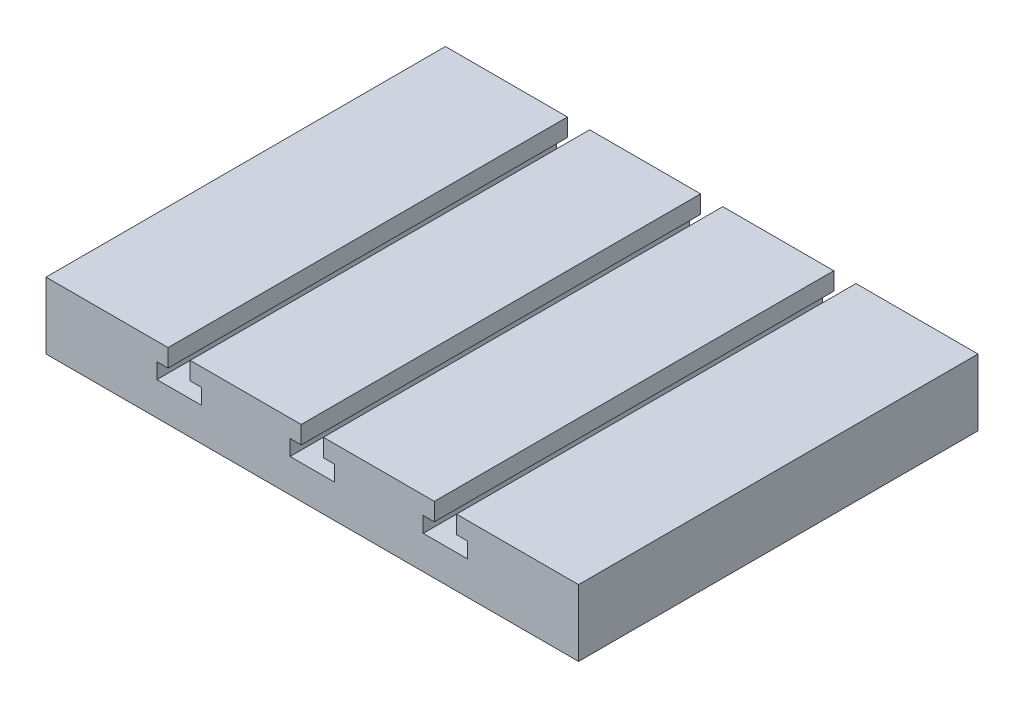
ISO-10303-21;
HEADER;
FILE_DESCRIPTION(('STEP AP214'),'2;1');
FILE_NAME('part.step','',(''),(''),'','','');
FILE_SCHEMA(('AUTOMOTIVE_DESIGN { 1 0 10303 214 1 1 1 1 }'));
ENDSEC;
DATA;
#1=APPLICATION_CONTEXT('core data for automotive mechanical design processes');
#2=APPLICATION_PROTOCOL_DEFINITION('international standard','automotive_design',2000,#1);
#3=PRODUCT_CONTEXT('',#1,'mechanical');
#4=PRODUCT('Part','Part','',(#3));
#5=PRODUCT_RELATED_PRODUCT_CATEGORY('part','',(#4));
#6=PRODUCT_DEFINITION_FORMATION('','',#4);
#7=PRODUCT_DEFINITION_CONTEXT('part definition',#1,'design');
#8=PRODUCT_DEFINITION('design','',#6,#7);
#9=PRODUCT_DEFINITION_SHAPE('','',#8);
#10=(LENGTH_UNIT() NAMED_UNIT(*) SI_UNIT(.MILLI.,.METRE.));
#11=(NAMED_UNIT(*) PLANE_ANGLE_UNIT() SI_UNIT($,.RADIAN.));
#12=(NAMED_UNIT(*) SI_UNIT($,.STERADIAN.) SOLID_ANGLE_UNIT());
#13=UNCERTAINTY_MEASURE_WITH_UNIT(LENGTH_MEASURE(1.E-05),#10,'distance_accuracy_value','');
#14=(GEOMETRIC_REPRESENTATION_CONTEXT(3) GLOBAL_UNCERTAINTY_ASSIGNED_CONTEXT((#13)) GLOBAL_UNIT_ASSIGNED_CONTEXT((#10,
#11,#12)) REPRESENTATION_CONTEXT('',''));
#15=CARTESIAN_POINT('',(0.,0.,0.));
#16=DIRECTION('',(0.,0.,1.));
#17=DIRECTION('',(1.,0.,0.));
#18=AXIS2_PLACEMENT_3D('',#15,#16,#17);
#19=CARTESIAN_POINT('',(60.,7.50000000000001,90.));
#20=DIRECTION('',(0.,-1.,0.));
#21=DIRECTION('',(1.,0.,0.));
#22=AXIS2_PLACEMENT_3D('',#19,#20,#21);
#23=PLANE('',#22);
#24=DIRECTION('',(-1.,0.,0.));
#25=VECTOR('',#24,1.);
#26=CARTESIAN_POINT('',(60.,7.50000000000001,90.));
#27=LINE('',#26,#25);
#28=CARTESIAN_POINT('',(-2.5,7.5,90.));
#29=VERTEX_POINT('',#28);
#30=CARTESIAN_POINT('',(-27.5,7.5,90.));
#31=VERTEX_POINT('',#30);
#32=EDGE_CURVE('E413',#29,#31,#27,.T.);
#33=ORIENTED_EDGE('',*,*,#32,.F.);
#34=DIRECTION('',(0.,0.,1.));
#35=VECTOR('',#34,1.);
#36=CARTESIAN_POINT('',(-2.5,7.5,0.));
#37=LINE('',#36,#35);
#38=CARTESIAN_POINT('',(-2.5,7.5,0.));
#39=VERTEX_POINT('',#38);
#40=EDGE_CURVE('E281',#39,#29,#37,.T.);
#41=ORIENTED_EDGE('',*,*,#40,.F.);
#42=DIRECTION('',(-1.,0.,0.));
#43=VECTOR('',#42,1.);
#44=CARTESIAN_POINT('',(60.,7.50000000000001,0.));
#45=LINE('',#44,#43);
#46=CARTESIAN_POINT('',(-27.5,7.5,0.));
#47=VERTEX_POINT('',#46);
#48=EDGE_CURVE('E424',#39,#47,#45,.T.);
#49=ORIENTED_EDGE('',*,*,#48,.T.);
#50=DIRECTION('',(0.,0.,1.));
#51=VECTOR('',#50,1.);
#52=CARTESIAN_POINT('',(-27.5,7.5,0.));
#53=LINE('',#52,#51);
#54=EDGE_CURVE('E304',#47,#31,#53,.T.);
#55=ORIENTED_EDGE('',*,*,#54,.T.);
#56=EDGE_LOOP('',(#33,#41,#49,#55));
#57=FACE_BOUND('',#56,.T.);
#58=ADVANCED_FACE('F33',(#57),#23,.F.);
#59=CARTESIAN_POINT('',(27.5,7.5,0.));
#60=VERTEX_POINT('',#59);
#61=CARTESIAN_POINT('',(2.5,7.5,0.));
#62=VERTEX_POINT('',#61);
#63=EDGE_CURVE('E423',#60,#62,#45,.T.);
#64=ORIENTED_EDGE('',*,*,#63,.T.);
#65=DIRECTION('',(0.,0.,1.));
#66=VECTOR('',#65,1.);
#67=CARTESIAN_POINT('',(2.5,7.5,0.));
#68=LINE('',#67,#66);
#69=CARTESIAN_POINT('',(2.5,7.5,90.));
#70=VERTEX_POINT('',#69);
#71=EDGE_CURVE('E48',#62,#70,#68,.T.);
#72=ORIENTED_EDGE('',*,*,#71,.T.);
#73=CARTESIAN_POINT('',(27.5,7.5,90.));
#74=VERTEX_POINT('',#73);
#75=EDGE_CURVE('E412',#74,#70,#27,.T.);
#76=ORIENTED_EDGE('',*,*,#75,.F.);
#77=DIRECTION('',(0.,0.,1.));
#78=VECTOR('',#77,1.);
#79=CARTESIAN_POINT('',(27.5,7.5,0.));
#80=LINE('',#79,#78);
#81=EDGE_CURVE('E395',#60,#74,#80,.T.);
#82=ORIENTED_EDGE('',*,*,#81,.F.);
#83=EDGE_LOOP('',(#64,#72,#76,#82));
#84=FACE_BOUND('',#83,.T.);
#85=ADVANCED_FACE('F458',(#84),#23,.F.);
#86=CARTESIAN_POINT('',(60.,7.50000000000001,0.));
#87=VERTEX_POINT('',#86);
#88=CARTESIAN_POINT('',(32.5,7.5,0.));
#89=VERTEX_POINT('',#88);
#90=EDGE_CURVE('E403',#87,#89,#45,.T.);
#91=ORIENTED_EDGE('',*,*,#90,.T.);
#92=DIRECTION('',(0.,0.,1.));
#93=VECTOR('',#92,1.);
#94=CARTESIAN_POINT('',(32.5,7.5,0.));
#95=LINE('',#94,#93);
#96=CARTESIAN_POINT('',(32.5,7.5,90.));
#97=VERTEX_POINT('',#96);
#98=EDGE_CURVE('E363',#89,#97,#95,.T.);
#99=ORIENTED_EDGE('',*,*,#98,.T.);
#100=CARTESIAN_POINT('',(60.,7.50000000000001,90.));
#101=VERTEX_POINT('',#100);
#102=EDGE_CURVE('E408',#101,#97,#27,.T.);
#103=ORIENTED_EDGE('',*,*,#102,.F.);
#104=DIRECTION('',(0.,0.,-1.));
#105=VECTOR('',#104,1.);
#106=CARTESIAN_POINT('',(60.,7.50000000000001,90.));
#107=LINE('',#106,#105);
#108=EDGE_CURVE('E427',#101,#87,#107,.T.);
#109=ORIENTED_EDGE('',*,*,#108,.T.);
#110=EDGE_LOOP('',(#91,#99,#103,#109));
#111=FACE_BOUND('',#110,.T.);
#112=ADVANCED_FACE('F441',(#111),#23,.F.);
#113=CARTESIAN_POINT('',(-60.,7.49999999999999,90.));
#114=DIRECTION('',(1.,0.,0.));
#115=DIRECTION('',(0.,0.,-1.));
#116=AXIS2_PLACEMENT_3D('',#113,#114,#115);
#117=PLANE('',#116);
#118=DIRECTION('',(0.,-1.,0.));
#119=VECTOR('',#118,1.);
#120=CARTESIAN_POINT('',(-60.,7.49999999999999,0.));
#121=LINE('',#120,#119);
#122=CARTESIAN_POINT('',(-60.,7.49999999999999,0.));
#123=VERTEX_POINT('',#122);
#124=CARTESIAN_POINT('',(-60.,-7.50000000000001,0.));
#125=VERTEX_POINT('',#124);
#126=EDGE_CURVE('E384',#123,#125,#121,.T.);
#127=ORIENTED_EDGE('',*,*,#126,.T.);
#128=DIRECTION('',(0.,0.,-1.));
#129=VECTOR('',#128,1.);
#130=CARTESIAN_POINT('',(-60.,-7.50000000000001,90.));
#131=LINE('',#130,#129);
#132=CARTESIAN_POINT('',(-60.,-7.50000000000001,90.));
#133=VERTEX_POINT('',#132);
#134=EDGE_CURVE('E11',#133,#125,#131,.T.);
#135=ORIENTED_EDGE('',*,*,#134,.F.);
#136=DIRECTION('',(0.,-1.,0.));
#137=VECTOR('',#136,1.);
#138=CARTESIAN_POINT('',(-60.,7.49999999999999,90.));
#139=LINE('',#138,#137);
#140=CARTESIAN_POINT('',(-60.,7.49999999999999,90.));
#141=VERTEX_POINT('',#140);
#142=EDGE_CURVE('E399',#141,#133,#139,.T.);
#143=ORIENTED_EDGE('',*,*,#142,.F.);
#144=DIRECTION('',(0.,0.,-1.));
#145=VECTOR('',#144,1.);
#146=CARTESIAN_POINT('',(-60.,7.49999999999999,90.));
#147=LINE('',#146,#145);
#148=EDGE_CURVE('E411',#141,#123,#147,.T.);
#149=ORIENTED_EDGE('',*,*,#148,.T.);
#150=EDGE_LOOP('',(#127,#135,#143,#149));
#151=FACE_BOUND('',#150,.T.);
#152=ADVANCED_FACE('F35',(#151),#117,.F.);
#153=CARTESIAN_POINT('',(60.,-7.49999999999999,90.));
#154=DIRECTION('',(0.,1.,0.));
#155=DIRECTION('',(-1.,0.,0.));
#156=AXIS2_PLACEMENT_3D('',#153,#154,#155);
#157=PLANE('',#156);
#158=DIRECTION('',(1.,0.,0.));
#159=VECTOR('',#158,1.);
#160=CARTESIAN_POINT('',(60.,-7.49999999999999,0.));
#161=LINE('',#160,#159);
#162=CARTESIAN_POINT('',(60.,-7.49999999999999,0.));
#163=VERTEX_POINT('',#162);
#164=EDGE_CURVE('E416',#125,#163,#161,.T.);
#165=ORIENTED_EDGE('',*,*,#164,.T.);
#166=DIRECTION('',(0.,0.,-1.));
#167=VECTOR('',#166,1.);
#168=CARTESIAN_POINT('',(60.,-7.49999999999999,90.));
#169=LINE('',#168,#167);
#170=CARTESIAN_POINT('',(60.,-7.49999999999999,90.));
#171=VERTEX_POINT('',#170);
#172=EDGE_CURVE('E41',#171,#163,#169,.T.);
#173=ORIENTED_EDGE('',*,*,#172,.F.);
#174=DIRECTION('',(1.,0.,0.));
#175=VECTOR('',#174,1.);
#176=CARTESIAN_POINT('',(60.,-7.49999999999999,90.));
#177=LINE('',#176,#175);
#178=EDGE_CURVE('E402',#133,#171,#177,.T.);
#179=ORIENTED_EDGE('',*,*,#178,.F.);
#180=ORIENTED_EDGE('',*,*,#134,.T.);
#181=EDGE_LOOP('',(#165,#173,#179,#180));
#182=FACE_BOUND('',#181,.T.);
#183=ADVANCED_FACE('F450',(#182),#157,.F.);
#184=CARTESIAN_POINT('',(60.,7.50000000000001,90.));
#185=DIRECTION('',(-1.,0.,0.));
#186=DIRECTION('',(0.,0.,1.));
#187=AXIS2_PLACEMENT_3D('',#184,#185,#186);
#188=PLANE('',#187);
#189=DIRECTION('',(0.,1.,0.));
#190=VECTOR('',#189,1.);
#191=CARTESIAN_POINT('',(60.,7.50000000000001,0.));
#192=LINE('',#191,#190);
#193=EDGE_CURVE('E418',#163,#87,#192,.T.);
#194=ORIENTED_EDGE('',*,*,#193,.T.);
#195=ORIENTED_EDGE('',*,*,#108,.F.);
#196=DIRECTION('',(0.,1.,0.));
#197=VECTOR('',#196,1.);
#198=CARTESIAN_POINT('',(60.,7.50000000000001,90.));
#199=LINE('',#198,#197);
#200=EDGE_CURVE('E405',#171,#101,#199,.T.);
#201=ORIENTED_EDGE('',*,*,#200,.F.);
#202=ORIENTED_EDGE('',*,*,#172,.T.);
#203=EDGE_LOOP('',(#194,#195,#201,#202));
#204=FACE_BOUND('',#203,.T.);
#205=ADVANCED_FACE('F434',(#204),#188,.F.);
#206=CARTESIAN_POINT('',(-32.5,7.5,90.));
#207=VERTEX_POINT('',#206);
#208=EDGE_CURVE('E407',#207,#141,#27,.T.);
#209=ORIENTED_EDGE('',*,*,#208,.F.);
#210=DIRECTION('',(0.,0.,1.));
#211=VECTOR('',#210,1.);
#212=CARTESIAN_POINT('',(-32.5,7.5,0.));
#213=LINE('',#212,#211);
#214=CARTESIAN_POINT('',(-32.5,7.5,0.));
#215=VERTEX_POINT('',#214);
#216=EDGE_CURVE('E337',#215,#207,#213,.T.);
#217=ORIENTED_EDGE('',*,*,#216,.F.);
#218=EDGE_CURVE('E420',#215,#123,#45,.T.);
#219=ORIENTED_EDGE('',*,*,#218,.T.);
#220=ORIENTED_EDGE('',*,*,#148,.F.);
#221=EDGE_LOOP('',(#209,#217,#219,#220));
#222=FACE_BOUND('',#221,.T.);
#223=ADVANCED_FACE('F499',(#222),#23,.F.);
#224=CARTESIAN_POINT('',(0.,0.,90.));
#225=DIRECTION('',(0.,0.,-1.));
#226=DIRECTION('',(-1.,0.,0.));
#227=AXIS2_PLACEMENT_3D('',#224,#225,#226);
#228=PLANE('',#227);
#229=DIRECTION('',(-1.,0.,0.));
#230=VECTOR('',#229,1.);
#231=CARTESIAN_POINT('',(-5.,3.49999999999999,90.));
#232=LINE('',#231,#230);
#233=CARTESIAN_POINT('',(-2.5,3.49999999999999,90.));
#234=VERTEX_POINT('',#233);
#235=CARTESIAN_POINT('',(-5.,3.49999999999999,90.));
#236=VERTEX_POINT('',#235);
#237=EDGE_CURVE('E262',#234,#236,#232,.T.);
#238=ORIENTED_EDGE('',*,*,#237,.F.);
#239=DIRECTION('',(0.,-1.,0.));
#240=VECTOR('',#239,1.);
#241=CARTESIAN_POINT('',(-2.5,7.5,90.));
#242=LINE('',#241,#240);
#243=EDGE_CURVE('E259',#29,#234,#242,.T.);
#244=ORIENTED_EDGE('',*,*,#243,.F.);
#245=ORIENTED_EDGE('',*,*,#32,.T.);
#246=DIRECTION('',(0.,1.,0.));
#247=VECTOR('',#246,1.);
#248=CARTESIAN_POINT('',(-27.5,7.5,90.));
#249=LINE('',#248,#247);
#250=CARTESIAN_POINT('',(-27.5,3.49999999999999,90.));
#251=VERTEX_POINT('',#250);
#252=EDGE_CURVE('E272',#251,#31,#249,.T.);
#253=ORIENTED_EDGE('',*,*,#252,.F.);
#254=DIRECTION('',(-1.,0.,0.));
#255=VECTOR('',#254,1.);
#256=CARTESIAN_POINT('',(-27.5,3.49999999999999,90.));
#257=LINE('',#256,#255);
#258=CARTESIAN_POINT('',(-25.,3.49999999999999,90.));
#259=VERTEX_POINT('',#258);
#260=EDGE_CURVE('E288',#259,#251,#257,.T.);
#261=ORIENTED_EDGE('',*,*,#260,.F.);
#262=DIRECTION('',(0.,1.,0.));
#263=VECTOR('',#262,1.);
#264=CARTESIAN_POINT('',(-25.,3.49999999999999,90.));
#265=LINE('',#264,#263);
#266=CARTESIAN_POINT('',(-25.,0.,90.));
#267=VERTEX_POINT('',#266);
#268=EDGE_CURVE('E319',#267,#259,#265,.T.);
#269=ORIENTED_EDGE('',*,*,#268,.F.);
#270=DIRECTION('',(1.,0.,0.));
#271=VECTOR('',#270,1.);
#272=CARTESIAN_POINT('',(-35.,0.,90.));
#273=LINE('',#272,#271);
#274=CARTESIAN_POINT('',(-35.,0.,90.));
#275=VERTEX_POINT('',#274);
#276=EDGE_CURVE('E316',#275,#267,#273,.T.);
#277=ORIENTED_EDGE('',*,*,#276,.F.);
#278=DIRECTION('',(0.,-1.,0.));
#279=VECTOR('',#278,1.);
#280=CARTESIAN_POINT('',(-35.,3.49999999999999,90.));
#281=LINE('',#280,#279);
#282=CARTESIAN_POINT('',(-35.,3.49999999999999,90.));
#283=VERTEX_POINT('',#282);
#284=EDGE_CURVE('E313',#283,#275,#281,.T.);
#285=ORIENTED_EDGE('',*,*,#284,.F.);
#286=DIRECTION('',(-1.,0.,0.));
#287=VECTOR('',#286,1.);
#288=CARTESIAN_POINT('',(-35.,3.49999999999999,90.));
#289=LINE('',#288,#287);
#290=CARTESIAN_POINT('',(-32.5,3.49999999999999,90.));
#291=VERTEX_POINT('',#290);
#292=EDGE_CURVE('E310',#291,#283,#289,.T.);
#293=ORIENTED_EDGE('',*,*,#292,.F.);
#294=DIRECTION('',(0.,-1.,0.));
#295=VECTOR('',#294,1.);
#296=CARTESIAN_POINT('',(-32.5,7.5,90.));
#297=LINE('',#296,#295);
#298=EDGE_CURVE('E307',#207,#291,#297,.T.);
#299=ORIENTED_EDGE('',*,*,#298,.F.);
#300=ORIENTED_EDGE('',*,*,#208,.T.);
#301=ORIENTED_EDGE('',*,*,#142,.T.);
#302=ORIENTED_EDGE('',*,*,#178,.T.);
#303=ORIENTED_EDGE('',*,*,#200,.T.);
#304=ORIENTED_EDGE('',*,*,#102,.T.);
#305=DIRECTION('',(0.,1.,0.));
#306=VECTOR('',#305,1.);
#307=CARTESIAN_POINT('',(32.5,7.5,90.));
#308=LINE('',#307,#306);
#309=CARTESIAN_POINT('',(32.5,3.49999999999999,90.));
#310=VERTEX_POINT('',#309);
#311=EDGE_CURVE('E326',#310,#97,#308,.T.);
#312=ORIENTED_EDGE('',*,*,#311,.F.);
#313=DIRECTION('',(-1.,0.,0.));
#314=VECTOR('',#313,1.);
#315=CARTESIAN_POINT('',(32.5,3.49999999999999,90.));
#316=LINE('',#315,#314);
#317=CARTESIAN_POINT('',(35.,3.49999999999999,90.));
#318=VERTEX_POINT('',#317);
#319=EDGE_CURVE('E345',#318,#310,#316,.T.);
#320=ORIENTED_EDGE('',*,*,#319,.F.);
#321=DIRECTION('',(0.,1.,0.));
#322=VECTOR('',#321,1.);
#323=CARTESIAN_POINT('',(35.,3.49999999999999,90.));
#324=LINE('',#323,#322);
#325=CARTESIAN_POINT('',(35.,0.,90.));
#326=VERTEX_POINT('',#325);
#327=EDGE_CURVE('E377',#326,#318,#324,.T.);
#328=ORIENTED_EDGE('',*,*,#327,.F.);
#329=DIRECTION('',(1.,0.,0.));
#330=VECTOR('',#329,1.);
#331=CARTESIAN_POINT('',(25.,0.,90.));
#332=LINE('',#331,#330);
#333=CARTESIAN_POINT('',(25.,0.,90.));
#334=VERTEX_POINT('',#333);
#335=EDGE_CURVE('E374',#334,#326,#332,.T.);
#336=ORIENTED_EDGE('',*,*,#335,.F.);
#337=DIRECTION('',(0.,-1.,0.));
#338=VECTOR('',#337,1.);
#339=CARTESIAN_POINT('',(25.,3.49999999999999,90.));
#340=LINE('',#339,#338);
#341=CARTESIAN_POINT('',(25.,3.49999999999999,90.));
#342=VERTEX_POINT('',#341);
#343=EDGE_CURVE('E371',#342,#334,#340,.T.);
#344=ORIENTED_EDGE('',*,*,#343,.F.);
#345=DIRECTION('',(-1.,0.,0.));
#346=VECTOR('',#345,1.);
#347=CARTESIAN_POINT('',(25.,3.49999999999999,90.));
#348=LINE('',#347,#346);
#349=CARTESIAN_POINT('',(27.5,3.49999999999999,90.));
#350=VERTEX_POINT('',#349);
#351=EDGE_CURVE('E368',#350,#342,#348,.T.);
#352=ORIENTED_EDGE('',*,*,#351,.F.);
#353=DIRECTION('',(0.,-1.,0.));
#354=VECTOR('',#353,1.);
#355=CARTESIAN_POINT('',(27.5,7.5,90.));
#356=LINE('',#355,#354);
#357=EDGE_CURVE('E365',#74,#350,#356,.T.);
#358=ORIENTED_EDGE('',*,*,#357,.F.);
#359=ORIENTED_EDGE('',*,*,#75,.T.);
#360=DIRECTION('',(0.,1.,0.));
#361=VECTOR('',#360,1.);
#362=CARTESIAN_POINT('',(2.5,7.5,90.));
#363=LINE('',#362,#361);
#364=CARTESIAN_POINT('',(2.5,3.49999999999999,90.));
#365=VERTEX_POINT('',#364);
#366=EDGE_CURVE('E257',#365,#70,#363,.T.);
#367=ORIENTED_EDGE('',*,*,#366,.F.);
#368=DIRECTION('',(-1.,0.,0.));
#369=VECTOR('',#368,1.);
#370=CARTESIAN_POINT('',(2.5,3.49999999999999,90.));
#371=LINE('',#370,#369);
#372=CARTESIAN_POINT('',(4.99999999999999,3.49999999999999,90.));
#373=VERTEX_POINT('',#372);
#374=EDGE_CURVE('E225',#373,#365,#371,.T.);
#375=ORIENTED_EDGE('',*,*,#374,.F.);
#376=DIRECTION('',(0.,1.,0.));
#377=VECTOR('',#376,1.);
#378=CARTESIAN_POINT('',(4.99999999999999,3.49999999999999,90.));
#379=LINE('',#378,#377);
#380=CARTESIAN_POINT('',(4.99999999999999,0.,90.));
#381=VERTEX_POINT('',#380);
#382=EDGE_CURVE('E240',#381,#373,#379,.T.);
#383=ORIENTED_EDGE('',*,*,#382,.F.);
#384=DIRECTION('',(1.,0.,0.));
#385=VECTOR('',#384,1.);
#386=CARTESIAN_POINT('',(-5.,0.,90.));
#387=LINE('',#386,#385);
#388=CARTESIAN_POINT('',(-5.,0.,90.));
#389=VERTEX_POINT('',#388);
#390=EDGE_CURVE('E243',#389,#381,#387,.T.);
#391=ORIENTED_EDGE('',*,*,#390,.F.);
#392=DIRECTION('',(0.,-1.,0.));
#393=VECTOR('',#392,1.);
#394=CARTESIAN_POINT('',(-5.,3.49999999999999,90.));
#395=LINE('',#394,#393);
#396=EDGE_CURVE('E265',#236,#389,#395,.T.);
#397=ORIENTED_EDGE('',*,*,#396,.F.);
#398=EDGE_LOOP('',(#238,#244,#245,#253,#261,#269,#277,#285,#293,#299,#300,#301,#302,#303,#304,
#312,#320,#328,#336,#344,#352,#358,#359,#367,#375,#383,#391,#397));
#399=FACE_BOUND('',#398,.T.);
#400=ADVANCED_FACE('F446',(#399),#228,.F.);
#401=CARTESIAN_POINT('',(0.,0.,0.));
#402=DIRECTION('',(0.,0.,-1.));
#403=DIRECTION('',(-1.,0.,0.));
#404=AXIS2_PLACEMENT_3D('',#401,#402,#403);
#405=PLANE('',#404);
#406=DIRECTION('',(0.,-1.,0.));
#407=VECTOR('',#406,1.);
#408=CARTESIAN_POINT('',(-2.5,7.5,0.));
#409=LINE('',#408,#407);
#410=CARTESIAN_POINT('',(-2.5,3.49999999999999,0.));
#411=VERTEX_POINT('',#410);
#412=EDGE_CURVE('E234',#39,#411,#409,.T.);
#413=ORIENTED_EDGE('',*,*,#412,.T.);
#414=DIRECTION('',(-1.,0.,0.));
#415=VECTOR('',#414,1.);
#416=CARTESIAN_POINT('',(-5.,3.49999999999999,0.));
#417=LINE('',#416,#415);
#418=CARTESIAN_POINT('',(-5.,3.49999999999999,0.));
#419=VERTEX_POINT('',#418);
#420=EDGE_CURVE('E247',#411,#419,#417,.T.);
#421=ORIENTED_EDGE('',*,*,#420,.T.);
#422=DIRECTION('',(0.,-1.,0.));
#423=VECTOR('',#422,1.);
#424=CARTESIAN_POINT('',(-5.,3.49999999999999,0.));
#425=LINE('',#424,#423);
#426=CARTESIAN_POINT('',(-5.,0.,0.));
#427=VERTEX_POINT('',#426);
#428=EDGE_CURVE('E250',#419,#427,#425,.T.);
#429=ORIENTED_EDGE('',*,*,#428,.T.);
#430=DIRECTION('',(1.,0.,0.));
#431=VECTOR('',#430,1.);
#432=CARTESIAN_POINT('',(-5.,0.,0.));
#433=LINE('',#432,#431);
#434=CARTESIAN_POINT('',(4.99999999999999,0.,0.));
#435=VERTEX_POINT('',#434);
#436=EDGE_CURVE('E253',#427,#435,#433,.T.);
#437=ORIENTED_EDGE('',*,*,#436,.T.);
#438=DIRECTION('',(0.,1.,0.));
#439=VECTOR('',#438,1.);
#440=CARTESIAN_POINT('',(4.99999999999999,3.49999999999999,0.));
#441=LINE('',#440,#439);
#442=CARTESIAN_POINT('',(4.99999999999999,3.49999999999999,0.));
#443=VERTEX_POINT('',#442);
#444=EDGE_CURVE('E227',#435,#443,#441,.T.);
#445=ORIENTED_EDGE('',*,*,#444,.T.);
#446=DIRECTION('',(-1.,0.,0.));
#447=VECTOR('',#446,1.);
#448=CARTESIAN_POINT('',(2.5,3.49999999999999,0.));
#449=LINE('',#448,#447);
#450=CARTESIAN_POINT('',(2.5,3.49999999999999,0.));
#451=VERTEX_POINT('',#450);
#452=EDGE_CURVE('E222',#443,#451,#449,.T.);
#453=ORIENTED_EDGE('',*,*,#452,.T.);
#454=DIRECTION('',(0.,1.,0.));
#455=VECTOR('',#454,1.);
#456=CARTESIAN_POINT('',(2.5,7.5,0.));
#457=LINE('',#456,#455);
#458=EDGE_CURVE('E229',#451,#62,#457,.T.);
#459=ORIENTED_EDGE('',*,*,#458,.T.);
#460=ORIENTED_EDGE('',*,*,#63,.F.);
#461=DIRECTION('',(0.,-1.,0.));
#462=VECTOR('',#461,1.);
#463=CARTESIAN_POINT('',(27.5,7.5,0.));
#464=LINE('',#463,#462);
#465=CARTESIAN_POINT('',(27.5,3.49999999999999,0.));
#466=VERTEX_POINT('',#465);
#467=EDGE_CURVE('E344',#60,#466,#464,.T.);
#468=ORIENTED_EDGE('',*,*,#467,.T.);
#469=DIRECTION('',(-1.,0.,0.));
#470=VECTOR('',#469,1.);
#471=CARTESIAN_POINT('',(25.,3.49999999999999,0.));
#472=LINE('',#471,#470);
#473=CARTESIAN_POINT('',(25.,3.49999999999999,0.));
#474=VERTEX_POINT('',#473);
#475=EDGE_CURVE('E348',#466,#474,#472,.T.);
#476=ORIENTED_EDGE('',*,*,#475,.T.);
#477=DIRECTION('',(0.,-1.,0.));
#478=VECTOR('',#477,1.);
#479=CARTESIAN_POINT('',(25.,3.49999999999999,0.));
#480=LINE('',#479,#478);
#481=CARTESIAN_POINT('',(25.,0.,0.));
#482=VERTEX_POINT('',#481);
#483=EDGE_CURVE('E351',#474,#482,#480,.T.);
#484=ORIENTED_EDGE('',*,*,#483,.T.);
#485=DIRECTION('',(1.,0.,0.));
#486=VECTOR('',#485,1.);
#487=CARTESIAN_POINT('',(25.,0.,0.));
#488=LINE('',#487,#486);
#489=CARTESIAN_POINT('',(35.,0.,0.));
#490=VERTEX_POINT('',#489);
#491=EDGE_CURVE('E354',#482,#490,#488,.T.);
#492=ORIENTED_EDGE('',*,*,#491,.T.);
#493=DIRECTION('',(0.,1.,0.));
#494=VECTOR('',#493,1.);
#495=CARTESIAN_POINT('',(35.,3.49999999999999,0.));
#496=LINE('',#495,#494);
#497=CARTESIAN_POINT('',(35.,3.49999999999999,0.));
#498=VERTEX_POINT('',#497);
#499=EDGE_CURVE('E357',#490,#498,#496,.T.);
#500=ORIENTED_EDGE('',*,*,#499,.T.);
#501=DIRECTION('',(-1.,0.,0.));
#502=VECTOR('',#501,1.);
#503=CARTESIAN_POINT('',(32.5,3.49999999999999,0.));
#504=LINE('',#503,#502);
#505=CARTESIAN_POINT('',(32.5,3.49999999999999,0.));
#506=VERTEX_POINT('',#505);
#507=EDGE_CURVE('E360',#498,#506,#504,.T.);
#508=ORIENTED_EDGE('',*,*,#507,.T.);
#509=DIRECTION('',(0.,1.,0.));
#510=VECTOR('',#509,1.);
#511=CARTESIAN_POINT('',(32.5,7.5,0.));
#512=LINE('',#511,#510);
#513=EDGE_CURVE('E341',#506,#89,#512,.T.);
#514=ORIENTED_EDGE('',*,*,#513,.T.);
#515=ORIENTED_EDGE('',*,*,#90,.F.);
#516=ORIENTED_EDGE('',*,*,#193,.F.);
#517=ORIENTED_EDGE('',*,*,#164,.F.);
#518=ORIENTED_EDGE('',*,*,#126,.F.);
#519=ORIENTED_EDGE('',*,*,#218,.F.);
#520=DIRECTION('',(0.,-1.,0.));
#521=VECTOR('',#520,1.);
#522=CARTESIAN_POINT('',(-32.5,7.5,0.));
#523=LINE('',#522,#521);
#524=CARTESIAN_POINT('',(-32.5,3.49999999999999,0.));
#525=VERTEX_POINT('',#524);
#526=EDGE_CURVE('E287',#215,#525,#523,.T.);
#527=ORIENTED_EDGE('',*,*,#526,.T.);
#528=DIRECTION('',(-1.,0.,0.));
#529=VECTOR('',#528,1.);
#530=CARTESIAN_POINT('',(-35.,3.49999999999999,0.));
#531=LINE('',#530,#529);
#532=CARTESIAN_POINT('',(-35.,3.49999999999999,0.));
#533=VERTEX_POINT('',#532);
#534=EDGE_CURVE('E56',#525,#533,#531,.T.);
#535=ORIENTED_EDGE('',*,*,#534,.T.);
#536=DIRECTION('',(0.,-1.,0.));
#537=VECTOR('',#536,1.);
#538=CARTESIAN_POINT('',(-35.,3.49999999999999,0.));
#539=LINE('',#538,#537);
#540=CARTESIAN_POINT('',(-35.,0.,0.));
#541=VERTEX_POINT('',#540);
#542=EDGE_CURVE('E292',#533,#541,#539,.T.);
#543=ORIENTED_EDGE('',*,*,#542,.T.);
#544=DIRECTION('',(1.,0.,0.));
#545=VECTOR('',#544,1.);
#546=CARTESIAN_POINT('',(-35.,0.,0.));
#547=LINE('',#546,#545);
#548=CARTESIAN_POINT('',(-25.,0.,0.));
#549=VERTEX_POINT('',#548);
#550=EDGE_CURVE('E295',#541,#549,#547,.T.);
#551=ORIENTED_EDGE('',*,*,#550,.T.);
#552=DIRECTION('',(0.,1.,0.));
#553=VECTOR('',#552,1.);
#554=CARTESIAN_POINT('',(-25.,3.49999999999999,0.));
#555=LINE('',#554,#553);
#556=CARTESIAN_POINT('',(-25.,3.49999999999999,0.));
#557=VERTEX_POINT('',#556);
#558=EDGE_CURVE('E298',#549,#557,#555,.T.);
#559=ORIENTED_EDGE('',*,*,#558,.T.);
#560=DIRECTION('',(-1.,0.,0.));
#561=VECTOR('',#560,1.);
#562=CARTESIAN_POINT('',(-27.5,3.49999999999999,0.));
#563=LINE('',#562,#561);
#564=CARTESIAN_POINT('',(-27.5,3.49999999999999,0.));
#565=VERTEX_POINT('',#564);
#566=EDGE_CURVE('E301',#557,#565,#563,.T.);
#567=ORIENTED_EDGE('',*,*,#566,.T.);
#568=DIRECTION('',(0.,1.,0.));
#569=VECTOR('',#568,1.);
#570=CARTESIAN_POINT('',(-27.5,7.5,0.));
#571=LINE('',#570,#569);
#572=EDGE_CURVE('E284',#565,#47,#571,.T.);
#573=ORIENTED_EDGE('',*,*,#572,.T.);
#574=ORIENTED_EDGE('',*,*,#48,.F.);
#575=EDGE_LOOP('',(#413,#421,#429,#437,#445,#453,#459,#460,#468,#476,#484,#492,#500,#508,#514,
#515,#516,#517,#518,#519,#527,#535,#543,#551,#559,#567,#573,#574));
#576=FACE_BOUND('',#575,.T.);
#577=ADVANCED_FACE('F237',(#576),#405,.T.);
#578=CARTESIAN_POINT('',(32.5,7.5,0.));
#579=DIRECTION('',(1.,0.,0.));
#580=DIRECTION('',(0.,0.,-1.));
#581=AXIS2_PLACEMENT_3D('',#578,#579,#580);
#582=PLANE('',#581);
#583=ORIENTED_EDGE('',*,*,#311,.T.);
#584=ORIENTED_EDGE('',*,*,#98,.F.);
#585=ORIENTED_EDGE('',*,*,#513,.F.);
#586=DIRECTION('',(0.,0.,1.));
#587=VECTOR('',#586,1.);
#588=CARTESIAN_POINT('',(32.5,3.49999999999999,0.));
#589=LINE('',#588,#587);
#590=EDGE_CURVE('E382',#506,#310,#589,.T.);
#591=ORIENTED_EDGE('',*,*,#590,.T.);
#592=EDGE_LOOP('',(#583,#584,#585,#591));
#593=FACE_BOUND('',#592,.T.);
#594=ADVANCED_FACE('F484',(#593),#582,.F.);
#595=CARTESIAN_POINT('',(32.5,3.49999999999999,0.));
#596=DIRECTION('',(0.,1.,0.));
#597=DIRECTION('',(0.,0.,1.));
#598=AXIS2_PLACEMENT_3D('',#595,#596,#597);
#599=PLANE('',#598);
#600=ORIENTED_EDGE('',*,*,#319,.T.);
#601=ORIENTED_EDGE('',*,*,#590,.F.);
#602=ORIENTED_EDGE('',*,*,#507,.F.);
#603=DIRECTION('',(0.,0.,1.));
#604=VECTOR('',#603,1.);
#605=CARTESIAN_POINT('',(35.,3.49999999999999,0.));
#606=LINE('',#605,#604);
#607=EDGE_CURVE('E385',#498,#318,#606,.T.);
#608=ORIENTED_EDGE('',*,*,#607,.T.);
#609=EDGE_LOOP('',(#600,#601,#602,#608));
#610=FACE_BOUND('',#609,.T.);
#611=ADVANCED_FACE('F482',(#610),#599,.F.);
#612=CARTESIAN_POINT('',(35.,3.49999999999999,0.));
#613=DIRECTION('',(1.,0.,0.));
#614=DIRECTION('',(0.,0.,-1.));
#615=AXIS2_PLACEMENT_3D('',#612,#613,#614);
#616=PLANE('',#615);
#617=ORIENTED_EDGE('',*,*,#327,.T.);
#618=ORIENTED_EDGE('',*,*,#607,.F.);
#619=ORIENTED_EDGE('',*,*,#499,.F.);
#620=DIRECTION('',(0.,0.,1.));
#621=VECTOR('',#620,1.);
#622=CARTESIAN_POINT('',(35.,0.,0.));
#623=LINE('',#622,#621);
#624=EDGE_CURVE('E387',#490,#326,#623,.T.);
#625=ORIENTED_EDGE('',*,*,#624,.T.);
#626=EDGE_LOOP('',(#617,#618,#619,#625));
#627=FACE_BOUND('',#626,.T.);
#628=ADVANCED_FACE('F479',(#627),#616,.F.);
#629=CARTESIAN_POINT('',(25.,0.,0.));
#630=DIRECTION('',(0.,-1.,0.));
#631=DIRECTION('',(1.,0.,0.));
#632=AXIS2_PLACEMENT_3D('',#629,#630,#631);
#633=PLANE('',#632);
#634=ORIENTED_EDGE('',*,*,#335,.T.);
#635=ORIENTED_EDGE('',*,*,#624,.F.);
#636=ORIENTED_EDGE('',*,*,#491,.F.);
#637=DIRECTION('',(0.,0.,1.));
#638=VECTOR('',#637,1.);
#639=CARTESIAN_POINT('',(25.,0.,0.));
#640=LINE('',#639,#638);
#641=EDGE_CURVE('E389',#482,#334,#640,.T.);
#642=ORIENTED_EDGE('',*,*,#641,.T.);
#643=EDGE_LOOP('',(#634,#635,#636,#642));
#644=FACE_BOUND('',#643,.T.);
#645=ADVANCED_FACE('F475',(#644),#633,.F.);
#646=CARTESIAN_POINT('',(25.,3.49999999999999,0.));
#647=DIRECTION('',(-1.,0.,0.));
#648=DIRECTION('',(0.,-1.,0.));
#649=AXIS2_PLACEMENT_3D('',#646,#647,#648);
#650=PLANE('',#649);
#651=ORIENTED_EDGE('',*,*,#343,.T.);
#652=ORIENTED_EDGE('',*,*,#641,.F.);
#653=ORIENTED_EDGE('',*,*,#483,.F.);
#654=DIRECTION('',(0.,0.,1.));
#655=VECTOR('',#654,1.);
#656=CARTESIAN_POINT('',(25.,3.49999999999999,0.));
#657=LINE('',#656,#655);
#658=EDGE_CURVE('E391',#474,#342,#657,.T.);
#659=ORIENTED_EDGE('',*,*,#658,.T.);
#660=EDGE_LOOP('',(#651,#652,#653,#659));
#661=FACE_BOUND('',#660,.T.);
#662=ADVANCED_FACE('F471',(#661),#650,.F.);
#663=CARTESIAN_POINT('',(25.,3.49999999999999,0.));
#664=DIRECTION('',(0.,1.,0.));
#665=DIRECTION('',(-1.,0.,0.));
#666=AXIS2_PLACEMENT_3D('',#663,#664,#665);
#667=PLANE('',#666);
#668=ORIENTED_EDGE('',*,*,#351,.T.);
#669=ORIENTED_EDGE('',*,*,#658,.F.);
#670=ORIENTED_EDGE('',*,*,#475,.F.);
#671=DIRECTION('',(0.,0.,1.));
#672=VECTOR('',#671,1.);
#673=CARTESIAN_POINT('',(27.5,3.49999999999999,0.));
#674=LINE('',#673,#672);
#675=EDGE_CURVE('E393',#466,#350,#674,.T.);
#676=ORIENTED_EDGE('',*,*,#675,.T.);
#677=EDGE_LOOP('',(#668,#669,#670,#676));
#678=FACE_BOUND('',#677,.T.);
#679=ADVANCED_FACE('F467',(#678),#667,.F.);
#680=CARTESIAN_POINT('',(27.5,7.5,0.));
#681=DIRECTION('',(-1.,0.,0.));
#682=DIRECTION('',(0.,-1.,0.));
#683=AXIS2_PLACEMENT_3D('',#680,#681,#682);
#684=PLANE('',#683);
#685=ORIENTED_EDGE('',*,*,#357,.T.);
#686=ORIENTED_EDGE('',*,*,#675,.F.);
#687=ORIENTED_EDGE('',*,*,#467,.F.);
#688=ORIENTED_EDGE('',*,*,#81,.T.);
#689=EDGE_LOOP('',(#685,#686,#687,#688));
#690=FACE_BOUND('',#689,.T.);
#691=ADVANCED_FACE('F463',(#690),#684,.F.);
#692=CARTESIAN_POINT('',(-27.5,7.5,0.));
#693=DIRECTION('',(1.,0.,0.));
#694=DIRECTION('',(0.,1.,0.));
#695=AXIS2_PLACEMENT_3D('',#692,#693,#694);
#696=PLANE('',#695);
#697=ORIENTED_EDGE('',*,*,#252,.T.);
#698=ORIENTED_EDGE('',*,*,#54,.F.);
#699=ORIENTED_EDGE('',*,*,#572,.F.);
#700=DIRECTION('',(0.,0.,1.));
#701=VECTOR('',#700,1.);
#702=CARTESIAN_POINT('',(-27.5,3.49999999999999,0.));
#703=LINE('',#702,#701);
#704=EDGE_CURVE('E324',#565,#251,#703,.T.);
#705=ORIENTED_EDGE('',*,*,#704,.T.);
#706=EDGE_LOOP('',(#697,#698,#699,#705));
#707=FACE_BOUND('',#706,.T.);
#708=ADVANCED_FACE('F597',(#707),#696,.F.);
#709=CARTESIAN_POINT('',(-27.5,3.49999999999999,0.));
#710=DIRECTION('',(0.,1.,0.));
#711=DIRECTION('',(0.,0.,1.));
#712=AXIS2_PLACEMENT_3D('',#709,#710,#711);
#713=PLANE('',#712);
#714=ORIENTED_EDGE('',*,*,#260,.T.);
#715=ORIENTED_EDGE('',*,*,#704,.F.);
#716=ORIENTED_EDGE('',*,*,#566,.F.);
#717=DIRECTION('',(0.,0.,1.));
#718=VECTOR('',#717,1.);
#719=CARTESIAN_POINT('',(-25.,3.49999999999999,0.));
#720=LINE('',#719,#718);
#721=EDGE_CURVE('E327',#557,#259,#720,.T.);
#722=ORIENTED_EDGE('',*,*,#721,.T.);
#723=EDGE_LOOP('',(#714,#715,#716,#722));
#724=FACE_BOUND('',#723,.T.);
#725=ADVANCED_FACE('F604',(#724),#713,.F.);
#726=CARTESIAN_POINT('',(-25.,3.49999999999999,0.));
#727=DIRECTION('',(1.,0.,0.));
#728=DIRECTION('',(0.,0.,-1.));
#729=AXIS2_PLACEMENT_3D('',#726,#727,#728);
#730=PLANE('',#729);
#731=ORIENTED_EDGE('',*,*,#268,.T.);
#732=ORIENTED_EDGE('',*,*,#721,.F.);
#733=ORIENTED_EDGE('',*,*,#558,.F.);
#734=DIRECTION('',(0.,0.,1.));
#735=VECTOR('',#734,1.);
#736=CARTESIAN_POINT('',(-25.,0.,0.));
#737=LINE('',#736,#735);
#738=EDGE_CURVE('E329',#549,#267,#737,.T.);
#739=ORIENTED_EDGE('',*,*,#738,.T.);
#740=EDGE_LOOP('',(#731,#732,#733,#739));
#741=FACE_BOUND('',#740,.T.);
#742=ADVANCED_FACE('F613',(#741),#730,.F.);
#743=CARTESIAN_POINT('',(-35.,0.,0.));
#744=DIRECTION('',(0.,-1.,0.));
#745=DIRECTION('',(1.,0.,0.));
#746=AXIS2_PLACEMENT_3D('',#743,#744,#745);
#747=PLANE('',#746);
#748=ORIENTED_EDGE('',*,*,#276,.T.);
#749=ORIENTED_EDGE('',*,*,#738,.F.);
#750=ORIENTED_EDGE('',*,*,#550,.F.);
#751=DIRECTION('',(0.,0.,1.));
#752=VECTOR('',#751,1.);
#753=CARTESIAN_POINT('',(-35.,0.,0.));
#754=LINE('',#753,#752);
#755=EDGE_CURVE('E331',#541,#275,#754,.T.);
#756=ORIENTED_EDGE('',*,*,#755,.T.);
#757=EDGE_LOOP('',(#748,#749,#750,#756));
#758=FACE_BOUND('',#757,.T.);
#759=ADVANCED_FACE('F622',(#758),#747,.F.);
#760=CARTESIAN_POINT('',(-35.,3.49999999999999,0.));
#761=DIRECTION('',(-1.,0.,0.));
#762=DIRECTION('',(0.,0.,1.));
#763=AXIS2_PLACEMENT_3D('',#760,#761,#762);
#764=PLANE('',#763);
#765=ORIENTED_EDGE('',*,*,#284,.T.);
#766=ORIENTED_EDGE('',*,*,#755,.F.);
#767=ORIENTED_EDGE('',*,*,#542,.F.);
#768=DIRECTION('',(0.,0.,1.));
#769=VECTOR('',#768,1.);
#770=CARTESIAN_POINT('',(-35.,3.49999999999999,0.));
#771=LINE('',#770,#769);
#772=EDGE_CURVE('E333',#533,#283,#771,.T.);
#773=ORIENTED_EDGE('',*,*,#772,.T.);
#774=EDGE_LOOP('',(#765,#766,#767,#773));
#775=FACE_BOUND('',#774,.T.);
#776=ADVANCED_FACE('F631',(#775),#764,.F.);
#777=CARTESIAN_POINT('',(-35.,3.49999999999999,0.));
#778=DIRECTION('',(0.,1.,0.));
#779=DIRECTION('',(0.,0.,1.));
#780=AXIS2_PLACEMENT_3D('',#777,#778,#779);
#781=PLANE('',#780);
#782=ORIENTED_EDGE('',*,*,#292,.T.);
#783=ORIENTED_EDGE('',*,*,#772,.F.);
#784=ORIENTED_EDGE('',*,*,#534,.F.);
#785=DIRECTION('',(0.,0.,1.));
#786=VECTOR('',#785,1.);
#787=CARTESIAN_POINT('',(-32.5,3.49999999999999,0.));
#788=LINE('',#787,#786);
#789=EDGE_CURVE('E335',#525,#291,#788,.T.);
#790=ORIENTED_EDGE('',*,*,#789,.T.);
#791=EDGE_LOOP('',(#782,#783,#784,#790));
#792=FACE_BOUND('',#791,.T.);
#793=ADVANCED_FACE('F640',(#792),#781,.F.);
#794=CARTESIAN_POINT('',(-32.5,7.5,0.));
#795=DIRECTION('',(-1.,0.,0.));
#796=DIRECTION('',(0.,0.,1.));
#797=AXIS2_PLACEMENT_3D('',#794,#795,#796);
#798=PLANE('',#797);
#799=ORIENTED_EDGE('',*,*,#298,.T.);
#800=ORIENTED_EDGE('',*,*,#789,.F.);
#801=ORIENTED_EDGE('',*,*,#526,.F.);
#802=ORIENTED_EDGE('',*,*,#216,.T.);
#803=EDGE_LOOP('',(#799,#800,#801,#802));
#804=FACE_BOUND('',#803,.T.);
#805=ADVANCED_FACE('F649',(#804),#798,.F.);
#806=CARTESIAN_POINT('',(2.5,3.49999999999999,0.));
#807=DIRECTION('',(0.,1.,0.));
#808=DIRECTION('',(-1.,0.,0.));
#809=AXIS2_PLACEMENT_3D('',#806,#807,#808);
#810=PLANE('',#809);
#811=ORIENTED_EDGE('',*,*,#374,.T.);
#812=DIRECTION('',(0.,0.,1.));
#813=VECTOR('',#812,1.);
#814=CARTESIAN_POINT('',(2.5,3.49999999999999,0.));
#815=LINE('',#814,#813);
#816=EDGE_CURVE('E219',#451,#365,#815,.T.);
#817=ORIENTED_EDGE('',*,*,#816,.F.);
#818=ORIENTED_EDGE('',*,*,#452,.F.);
#819=DIRECTION('',(0.,0.,1.));
#820=VECTOR('',#819,1.);
#821=CARTESIAN_POINT('',(4.99999999999999,3.49999999999999,0.));
#822=LINE('',#821,#820);
#823=EDGE_CURVE('E270',#443,#373,#822,.T.);
#824=ORIENTED_EDGE('',*,*,#823,.T.);
#825=EDGE_LOOP('',(#811,#817,#818,#824));
#826=FACE_BOUND('',#825,.T.);
#827=ADVANCED_FACE('F220',(#826),#810,.F.);
#828=CARTESIAN_POINT('',(4.99999999999999,3.49999999999999,0.));
#829=DIRECTION('',(1.,0.,0.));
#830=DIRECTION('',(0.,0.,-1.));
#831=AXIS2_PLACEMENT_3D('',#828,#829,#830);
#832=PLANE('',#831);
#833=ORIENTED_EDGE('',*,*,#382,.T.);
#834=ORIENTED_EDGE('',*,*,#823,.F.);
#835=ORIENTED_EDGE('',*,*,#444,.F.);
#836=DIRECTION('',(0.,0.,1.));
#837=VECTOR('',#836,1.);
#838=CARTESIAN_POINT('',(4.99999999999999,0.,0.));
#839=LINE('',#838,#837);
#840=EDGE_CURVE('E273',#435,#381,#839,.T.);
#841=ORIENTED_EDGE('',*,*,#840,.T.);
#842=EDGE_LOOP('',(#833,#834,#835,#841));
#843=FACE_BOUND('',#842,.T.);
#844=ADVANCED_FACE('F665',(#843),#832,.F.);
#845=CARTESIAN_POINT('',(-5.,0.,0.));
#846=DIRECTION('',(0.,-1.,0.));
#847=DIRECTION('',(1.,0.,0.));
#848=AXIS2_PLACEMENT_3D('',#845,#846,#847);
#849=PLANE('',#848);
#850=ORIENTED_EDGE('',*,*,#390,.T.);
#851=ORIENTED_EDGE('',*,*,#840,.F.);
#852=ORIENTED_EDGE('',*,*,#436,.F.);
#853=DIRECTION('',(0.,0.,1.));
#854=VECTOR('',#853,1.);
#855=CARTESIAN_POINT('',(-5.,0.,0.));
#856=LINE('',#855,#854);
#857=EDGE_CURVE('E275',#427,#389,#856,.T.);
#858=ORIENTED_EDGE('',*,*,#857,.T.);
#859=EDGE_LOOP('',(#850,#851,#852,#858));
#860=FACE_BOUND('',#859,.T.);
#861=ADVANCED_FACE('F673',(#860),#849,.F.);
#862=CARTESIAN_POINT('',(-5.,3.49999999999999,0.));
#863=DIRECTION('',(-1.,0.,0.));
#864=DIRECTION('',(0.,-1.,0.));
#865=AXIS2_PLACEMENT_3D('',#862,#863,#864);
#866=PLANE('',#865);
#867=ORIENTED_EDGE('',*,*,#396,.T.);
#868=ORIENTED_EDGE('',*,*,#857,.F.);
#869=ORIENTED_EDGE('',*,*,#428,.F.);
#870=DIRECTION('',(0.,0.,1.));
#871=VECTOR('',#870,1.);
#872=CARTESIAN_POINT('',(-5.,3.49999999999999,0.));
#873=LINE('',#872,#871);
#874=EDGE_CURVE('E277',#419,#236,#873,.T.);
#875=ORIENTED_EDGE('',*,*,#874,.T.);
#876=EDGE_LOOP('',(#867,#868,#869,#875));
#877=FACE_BOUND('',#876,.T.);
#878=ADVANCED_FACE('F682',(#877),#866,.F.);
#879=CARTESIAN_POINT('',(-5.,3.49999999999999,0.));
#880=DIRECTION('',(0.,1.,0.));
#881=DIRECTION('',(0.,0.,1.));
#882=AXIS2_PLACEMENT_3D('',#879,#880,#881);
#883=PLANE('',#882);
#884=ORIENTED_EDGE('',*,*,#237,.T.);
#885=ORIENTED_EDGE('',*,*,#874,.F.);
#886=ORIENTED_EDGE('',*,*,#420,.F.);
#887=DIRECTION('',(0.,0.,1.));
#888=VECTOR('',#887,1.);
#889=CARTESIAN_POINT('',(-2.5,3.49999999999999,0.));
#890=LINE('',#889,#888);
#891=EDGE_CURVE('E279',#411,#234,#890,.T.);
#892=ORIENTED_EDGE('',*,*,#891,.T.);
#893=EDGE_LOOP('',(#884,#885,#886,#892));
#894=FACE_BOUND('',#893,.T.);
#895=ADVANCED_FACE('F691',(#894),#883,.F.);
#896=CARTESIAN_POINT('',(-2.5,7.5,0.));
#897=DIRECTION('',(-1.,0.,0.));
#898=DIRECTION('',(0.,-1.,0.));
#899=AXIS2_PLACEMENT_3D('',#896,#897,#898);
#900=PLANE('',#899);
#901=ORIENTED_EDGE('',*,*,#243,.T.);
#902=ORIENTED_EDGE('',*,*,#891,.F.);
#903=ORIENTED_EDGE('',*,*,#412,.F.);
#904=ORIENTED_EDGE('',*,*,#40,.T.);
#905=EDGE_LOOP('',(#901,#902,#903,#904));
#906=FACE_BOUND('',#905,.T.);
#907=ADVANCED_FACE('F700',(#906),#900,.F.);
#908=CARTESIAN_POINT('',(2.5,7.5,0.));
#909=DIRECTION('',(1.,0.,0.));
#910=DIRECTION('',(0.,1.,0.));
#911=AXIS2_PLACEMENT_3D('',#908,#909,#910);
#912=PLANE('',#911);
#913=ORIENTED_EDGE('',*,*,#366,.T.);
#914=ORIENTED_EDGE('',*,*,#71,.F.);
#915=ORIENTED_EDGE('',*,*,#458,.F.);
#916=ORIENTED_EDGE('',*,*,#816,.T.);
#917=EDGE_LOOP('',(#913,#914,#915,#916));
#918=FACE_BOUND('',#917,.T.);
#919=ADVANCED_FACE('F230',(#918),#912,.F.);
#920=CLOSED_SHELL('',(#58,#85,#112,#152,#183,#205,#223,#400,#577,#594,#611,#628,#645,#662,#679,
#691,#708,#725,#742,#759,#776,#793,#805,#827,#844,#861,#878,#895,#907,#919));
#921=MANIFOLD_SOLID_BREP('B2',#920);
#922=ADVANCED_BREP_SHAPE_REPRESENTATION('',(#18,#921),#14);
#923=SHAPE_DEFINITION_REPRESENTATION(#9,#922);
ENDSEC;
END-ISO-10303-21;
